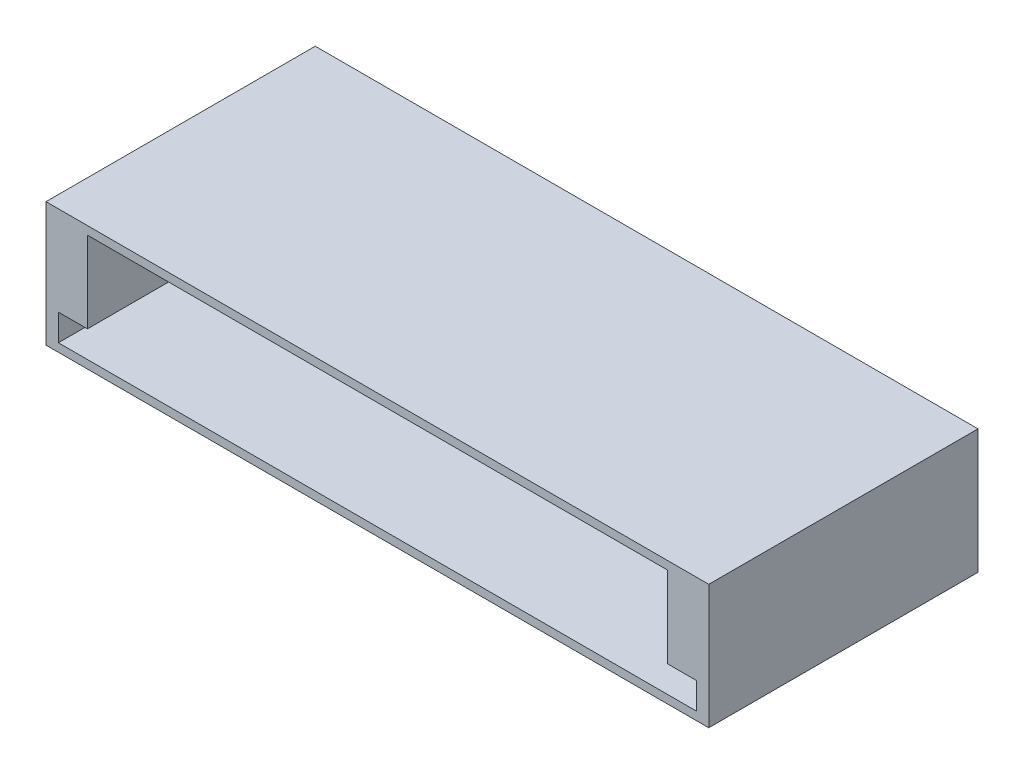
ISO-10303-21;
HEADER;
FILE_DESCRIPTION(('STEP AP214'),'2;1');
FILE_NAME('part.step','',(''),(''),'','','');
FILE_SCHEMA(('AUTOMOTIVE_DESIGN { 1 0 10303 214 1 1 1 1 }'));
ENDSEC;
DATA;
#1=APPLICATION_CONTEXT('core data for automotive mechanical design processes');
#2=APPLICATION_PROTOCOL_DEFINITION('international standard','automotive_design',2000,#1);
#3=PRODUCT_CONTEXT('',#1,'mechanical');
#4=PRODUCT('Part','Part','',(#3));
#5=PRODUCT_RELATED_PRODUCT_CATEGORY('part','',(#4));
#6=PRODUCT_DEFINITION_FORMATION('','',#4);
#7=PRODUCT_DEFINITION_CONTEXT('part definition',#1,'design');
#8=PRODUCT_DEFINITION('design','',#6,#7);
#9=PRODUCT_DEFINITION_SHAPE('','',#8);
#10=(LENGTH_UNIT() NAMED_UNIT(*) SI_UNIT(.MILLI.,.METRE.));
#11=(NAMED_UNIT(*) PLANE_ANGLE_UNIT() SI_UNIT($,.RADIAN.));
#12=(NAMED_UNIT(*) SI_UNIT($,.STERADIAN.) SOLID_ANGLE_UNIT());
#13=UNCERTAINTY_MEASURE_WITH_UNIT(LENGTH_MEASURE(1.E-05),#10,'distance_accuracy_value','');
#14=(GEOMETRIC_REPRESENTATION_CONTEXT(3) GLOBAL_UNCERTAINTY_ASSIGNED_CONTEXT((#13)) GLOBAL_UNIT_ASSIGNED_CONTEXT((#10,
#11,#12)) REPRESENTATION_CONTEXT('',''));
#15=CARTESIAN_POINT('',(0.,0.,0.));
#16=DIRECTION('',(0.,0.,1.));
#17=DIRECTION('',(1.,0.,0.));
#18=AXIS2_PLACEMENT_3D('',#15,#16,#17);
#19=CARTESIAN_POINT('',(-54.8518874800833,15.,22.8947008612522));
#20=DIRECTION('',(0.,0.,-1.));
#21=DIRECTION('',(-1.,0.,0.));
#22=AXIS2_PLACEMENT_3D('',#19,#20,#21);
#23=PLANE('',#22);
#24=DIRECTION('',(1.,0.,0.));
#25=VECTOR('',#24,1.);
#26=CARTESIAN_POINT('',(-49.8518874800834,1.,22.8947008612522));
#27=LINE('',#26,#25);
#28=CARTESIAN_POINT('',(-53.3518874800834,1.,22.8947008612522));
#29=VERTEX_POINT('',#28);
#30=CARTESIAN_POINT('',(23.6481125199167,1.,22.8947008612522));
#31=VERTEX_POINT('',#30);
#32=EDGE_CURVE('E176',#29,#31,#27,.T.);
#33=ORIENTED_EDGE('',*,*,#32,.F.);
#34=DIRECTION('',(0.,-1.,0.));
#35=VECTOR('',#34,1.);
#36=CARTESIAN_POINT('',(-53.3518874800834,1.,22.8947008612522));
#37=LINE('',#36,#35);
#38=CARTESIAN_POINT('',(-53.3518874800834,4.2,22.8947008612522));
#39=VERTEX_POINT('',#38);
#40=EDGE_CURVE('E152',#39,#29,#37,.T.);
#41=ORIENTED_EDGE('',*,*,#40,.F.);
#42=DIRECTION('',(-1.,0.,0.));
#43=VECTOR('',#42,1.);
#44=CARTESIAN_POINT('',(-53.3518874800834,4.2,22.8947008612522));
#45=LINE('',#44,#43);
#46=CARTESIAN_POINT('',(-49.8518874800834,4.2,22.8947008612522));
#47=VERTEX_POINT('',#46);
#48=EDGE_CURVE('E160',#47,#39,#45,.T.);
#49=ORIENTED_EDGE('',*,*,#48,.F.);
#50=DIRECTION('',(0.,-1.,0.));
#51=VECTOR('',#50,1.);
#52=CARTESIAN_POINT('',(-49.8518874800834,1.,22.8947008612522));
#53=LINE('',#52,#51);
#54=CARTESIAN_POINT('',(-49.8518874800834,14.,22.8947008612522));
#55=VERTEX_POINT('',#54);
#56=EDGE_CURVE('E187',#55,#47,#53,.T.);
#57=ORIENTED_EDGE('',*,*,#56,.F.);
#58=DIRECTION('',(-1.,0.,0.));
#59=VECTOR('',#58,1.);
#60=CARTESIAN_POINT('',(-49.8518874800834,14.,22.8947008612522));
#61=LINE('',#60,#59);
#62=CARTESIAN_POINT('',(20.1481125199167,14.,22.8947008612522));
#63=VERTEX_POINT('',#62);
#64=EDGE_CURVE('E184',#63,#55,#61,.T.);
#65=ORIENTED_EDGE('',*,*,#64,.F.);
#66=DIRECTION('',(0.,1.,0.));
#67=VECTOR('',#66,1.);
#68=CARTESIAN_POINT('',(20.1481125199167,1.,22.8947008612522));
#69=LINE('',#68,#67);
#70=CARTESIAN_POINT('',(20.1481125199167,4.2,22.8947008612522));
#71=VERTEX_POINT('',#70);
#72=EDGE_CURVE('E63',#71,#63,#69,.T.);
#73=ORIENTED_EDGE('',*,*,#72,.F.);
#74=CARTESIAN_POINT('',(23.6481125199167,4.2,22.8947008612522));
#75=VERTEX_POINT('',#74);
#76=EDGE_CURVE('E155',#75,#71,#45,.T.);
#77=ORIENTED_EDGE('',*,*,#76,.F.);
#78=DIRECTION('',(0.,1.,0.));
#79=VECTOR('',#78,1.);
#80=CARTESIAN_POINT('',(23.6481125199167,1.,22.8947008612522));
#81=LINE('',#80,#79);
#82=EDGE_CURVE('E136',#31,#75,#81,.T.);
#83=ORIENTED_EDGE('',*,*,#82,.F.);
#84=EDGE_LOOP('',(#33,#41,#49,#57,#65,#73,#77,#83));
#85=FACE_BOUND('',#84,.T.);
#86=DIRECTION('',(1.,0.,0.));
#87=VECTOR('',#86,1.);
#88=CARTESIAN_POINT('',(-54.8518874800833,0.,22.8947008612522));
#89=LINE('',#88,#87);
#90=CARTESIAN_POINT('',(-54.8518874800833,0.,22.8947008612522));
#91=VERTEX_POINT('',#90);
#92=CARTESIAN_POINT('',(25.1481125199166,0.,22.8947008612522));
#93=VERTEX_POINT('',#92);
#94=EDGE_CURVE('E193',#91,#93,#89,.T.);
#95=ORIENTED_EDGE('',*,*,#94,.T.);
#96=DIRECTION('',(0.,-1.,0.));
#97=VECTOR('',#96,1.);
#98=CARTESIAN_POINT('',(25.1481125199166,15.,22.8947008612522));
#99=LINE('',#98,#97);
#100=CARTESIAN_POINT('',(25.1481125199166,15.,22.8947008612522));
#101=VERTEX_POINT('',#100);
#102=EDGE_CURVE('E11',#101,#93,#99,.T.);
#103=ORIENTED_EDGE('',*,*,#102,.F.);
#104=DIRECTION('',(1.,0.,0.));
#105=VECTOR('',#104,1.);
#106=CARTESIAN_POINT('',(-54.8518874800833,15.,22.8947008612522));
#107=LINE('',#106,#105);
#108=CARTESIAN_POINT('',(-54.8518874800833,15.,22.8947008612522));
#109=VERTEX_POINT('',#108);
#110=EDGE_CURVE('E195',#109,#101,#107,.T.);
#111=ORIENTED_EDGE('',*,*,#110,.F.);
#112=DIRECTION('',(0.,-1.,0.));
#113=VECTOR('',#112,1.);
#114=CARTESIAN_POINT('',(-54.8518874800833,15.,22.8947008612522));
#115=LINE('',#114,#113);
#116=EDGE_CURVE('E206',#109,#91,#115,.T.);
#117=ORIENTED_EDGE('',*,*,#116,.T.);
#118=EDGE_LOOP('',(#95,#103,#111,#117));
#119=FACE_BOUND('',#118,.T.);
#120=ADVANCED_FACE('F41',(#85,#119),#23,.F.);
#121=CARTESIAN_POINT('',(25.1481125199166,15.,-9.60529913874782));
#122=DIRECTION('',(1.,0.,0.));
#123=DIRECTION('',(0.,0.,-1.));
#124=AXIS2_PLACEMENT_3D('',#121,#122,#123);
#125=PLANE('',#124);
#126=DIRECTION('',(0.,0.,1.));
#127=VECTOR('',#126,1.);
#128=CARTESIAN_POINT('',(25.1481125199166,0.,-9.60529913874782));
#129=LINE('',#128,#127);
#130=CARTESIAN_POINT('',(25.1481125199166,0.,-9.60529913874782));
#131=VERTEX_POINT('',#130);
#132=EDGE_CURVE('E209',#131,#93,#129,.T.);
#133=ORIENTED_EDGE('',*,*,#132,.F.);
#134=DIRECTION('',(0.,-1.,0.));
#135=VECTOR('',#134,1.);
#136=CARTESIAN_POINT('',(25.1481125199166,15.,-9.60529913874782));
#137=LINE('',#136,#135);
#138=CARTESIAN_POINT('',(25.1481125199166,15.,-9.60529913874782));
#139=VERTEX_POINT('',#138);
#140=EDGE_CURVE('E48',#139,#131,#137,.T.);
#141=ORIENTED_EDGE('',*,*,#140,.F.);
#142=DIRECTION('',(0.,0.,1.));
#143=VECTOR('',#142,1.);
#144=CARTESIAN_POINT('',(25.1481125199166,15.,-9.60529913874782));
#145=LINE('',#144,#143);
#146=EDGE_CURVE('E197',#139,#101,#145,.T.);
#147=ORIENTED_EDGE('',*,*,#146,.T.);
#148=ORIENTED_EDGE('',*,*,#102,.T.);
#149=EDGE_LOOP('',(#133,#141,#147,#148));
#150=FACE_BOUND('',#149,.T.);
#151=ADVANCED_FACE('F226',(#150),#125,.T.);
#152=CARTESIAN_POINT('',(-54.8518874800833,15.,-9.60529913874782));
#153=DIRECTION('',(0.,0.,-1.));
#154=DIRECTION('',(-1.,0.,0.));
#155=AXIS2_PLACEMENT_3D('',#152,#153,#154);
#156=PLANE('',#155);
#157=DIRECTION('',(1.,0.,0.));
#158=VECTOR('',#157,1.);
#159=CARTESIAN_POINT('',(-54.8518874800833,0.,-9.60529913874782));
#160=LINE('',#159,#158);
#161=CARTESIAN_POINT('',(-54.8518874800833,0.,-9.60529913874782));
#162=VERTEX_POINT('',#161);
#163=EDGE_CURVE('E212',#162,#131,#160,.T.);
#164=ORIENTED_EDGE('',*,*,#163,.F.);
#165=DIRECTION('',(0.,-1.,0.));
#166=VECTOR('',#165,1.);
#167=CARTESIAN_POINT('',(-54.8518874800833,15.,-9.60529913874782));
#168=LINE('',#167,#166);
#169=CARTESIAN_POINT('',(-54.8518874800833,15.,-9.60529913874782));
#170=VERTEX_POINT('',#169);
#171=EDGE_CURVE('E218',#170,#162,#168,.T.);
#172=ORIENTED_EDGE('',*,*,#171,.F.);
#173=DIRECTION('',(1.,0.,0.));
#174=VECTOR('',#173,1.);
#175=CARTESIAN_POINT('',(-54.8518874800833,15.,-9.60529913874782));
#176=LINE('',#175,#174);
#177=EDGE_CURVE('E201',#170,#139,#176,.T.);
#178=ORIENTED_EDGE('',*,*,#177,.T.);
#179=ORIENTED_EDGE('',*,*,#140,.T.);
#180=EDGE_LOOP('',(#164,#172,#178,#179));
#181=FACE_BOUND('',#180,.T.);
#182=ADVANCED_FACE('F222',(#181),#156,.T.);
#183=CARTESIAN_POINT('',(-54.8518874800833,15.,-9.60529913874782));
#184=DIRECTION('',(1.,0.,0.));
#185=DIRECTION('',(0.,0.,-1.));
#186=AXIS2_PLACEMENT_3D('',#183,#184,#185);
#187=PLANE('',#186);
#188=DIRECTION('',(0.,0.,1.));
#189=VECTOR('',#188,1.);
#190=CARTESIAN_POINT('',(-54.8518874800833,0.,-9.60529913874782));
#191=LINE('',#190,#189);
#192=EDGE_CURVE('E198',#162,#91,#191,.T.);
#193=ORIENTED_EDGE('',*,*,#192,.T.);
#194=ORIENTED_EDGE('',*,*,#116,.F.);
#195=DIRECTION('',(0.,0.,1.));
#196=VECTOR('',#195,1.);
#197=CARTESIAN_POINT('',(-54.8518874800833,15.,-9.60529913874782));
#198=LINE('',#197,#196);
#199=EDGE_CURVE('E204',#170,#109,#198,.T.);
#200=ORIENTED_EDGE('',*,*,#199,.F.);
#201=ORIENTED_EDGE('',*,*,#171,.T.);
#202=EDGE_LOOP('',(#193,#194,#200,#201));
#203=FACE_BOUND('',#202,.T.);
#204=ADVANCED_FACE('F234',(#203),#187,.F.);
#205=CARTESIAN_POINT('',(0.,15.,0.));
#206=DIRECTION('',(0.,-1.,0.));
#207=DIRECTION('',(0.,0.,-1.));
#208=AXIS2_PLACEMENT_3D('',#205,#206,#207);
#209=PLANE('',#208);
#210=ORIENTED_EDGE('',*,*,#110,.T.);
#211=ORIENTED_EDGE('',*,*,#146,.F.);
#212=ORIENTED_EDGE('',*,*,#177,.F.);
#213=ORIENTED_EDGE('',*,*,#199,.T.);
#214=EDGE_LOOP('',(#210,#211,#212,#213));
#215=FACE_BOUND('',#214,.T.);
#216=ADVANCED_FACE('F239',(#215),#209,.F.);
#217=CARTESIAN_POINT('',(0.,0.,0.));
#218=DIRECTION('',(0.,-1.,0.));
#219=DIRECTION('',(0.,0.,-1.));
#220=AXIS2_PLACEMENT_3D('',#217,#218,#219);
#221=PLANE('',#220);
#222=ORIENTED_EDGE('',*,*,#94,.F.);
#223=ORIENTED_EDGE('',*,*,#192,.F.);
#224=ORIENTED_EDGE('',*,*,#163,.T.);
#225=ORIENTED_EDGE('',*,*,#132,.T.);
#226=EDGE_LOOP('',(#222,#223,#224,#225));
#227=FACE_BOUND('',#226,.T.);
#228=ADVANCED_FACE('F231',(#227),#221,.T.);
#229=CARTESIAN_POINT('',(20.1481125199167,1.,-7.10529913874781));
#230=DIRECTION('',(1.,0.,0.));
#231=DIRECTION('',(0.,0.,-1.));
#232=AXIS2_PLACEMENT_3D('',#229,#230,#231);
#233=PLANE('',#232);
#234=DIRECTION('',(0.,1.,0.));
#235=VECTOR('',#234,1.);
#236=CARTESIAN_POINT('',(20.1481125199167,1.,-7.10529913874781));
#237=LINE('',#236,#235);
#238=CARTESIAN_POINT('',(20.1481125199167,4.2,-7.10529913874781));
#239=VERTEX_POINT('',#238);
#240=CARTESIAN_POINT('',(20.1481125199167,14.,-7.10529913874781));
#241=VERTEX_POINT('',#240);
#242=EDGE_CURVE('E173',#239,#241,#237,.T.);
#243=ORIENTED_EDGE('',*,*,#242,.F.);
#244=DIRECTION('',(0.,0.,1.));
#245=VECTOR('',#244,1.);
#246=CARTESIAN_POINT('',(20.1481125199167,4.2,-7.10529913874781));
#247=LINE('',#246,#245);
#248=EDGE_CURVE('E143',#239,#71,#247,.T.);
#249=ORIENTED_EDGE('',*,*,#248,.T.);
#250=ORIENTED_EDGE('',*,*,#72,.T.);
#251=DIRECTION('',(0.,0.,1.));
#252=VECTOR('',#251,1.);
#253=CARTESIAN_POINT('',(20.1481125199167,14.,-7.10529913874781));
#254=LINE('',#253,#252);
#255=EDGE_CURVE('E182',#241,#63,#254,.T.);
#256=ORIENTED_EDGE('',*,*,#255,.F.);
#257=EDGE_LOOP('',(#243,#249,#250,#256));
#258=FACE_BOUND('',#257,.T.);
#259=ADVANCED_FACE('F246',(#258),#233,.F.);
#260=CARTESIAN_POINT('',(-49.8518874800834,1.,-7.10529913874781));
#261=DIRECTION('',(0.,-1.,0.));
#262=DIRECTION('',(0.,0.,-1.));
#263=AXIS2_PLACEMENT_3D('',#260,#261,#262);
#264=PLANE('',#263);
#265=ORIENTED_EDGE('',*,*,#32,.T.);
#266=DIRECTION('',(0.,0.,1.));
#267=VECTOR('',#266,1.);
#268=CARTESIAN_POINT('',(23.6481125199167,1.,-7.10529913874781));
#269=LINE('',#268,#267);
#270=CARTESIAN_POINT('',(23.6481125199167,1.,-7.10529913874781));
#271=VERTEX_POINT('',#270);
#272=EDGE_CURVE('E162',#271,#31,#269,.T.);
#273=ORIENTED_EDGE('',*,*,#272,.F.);
#274=DIRECTION('',(1.,0.,0.));
#275=VECTOR('',#274,1.);
#276=CARTESIAN_POINT('',(-49.8518874800834,1.,-7.10529913874781));
#277=LINE('',#276,#275);
#278=CARTESIAN_POINT('',(-53.3518874800834,1.,-7.10529913874781));
#279=VERTEX_POINT('',#278);
#280=EDGE_CURVE('E150',#279,#271,#277,.T.);
#281=ORIENTED_EDGE('',*,*,#280,.F.);
#282=DIRECTION('',(0.,0.,1.));
#283=VECTOR('',#282,1.);
#284=CARTESIAN_POINT('',(-53.3518874800834,1.,-7.10529913874781));
#285=LINE('',#284,#283);
#286=EDGE_CURVE('E165',#279,#29,#285,.T.);
#287=ORIENTED_EDGE('',*,*,#286,.T.);
#288=EDGE_LOOP('',(#265,#273,#281,#287));
#289=FACE_BOUND('',#288,.T.);
#290=ADVANCED_FACE('F261',(#289),#264,.F.);
#291=CARTESIAN_POINT('',(-49.8518874800834,1.,-7.10529913874781));
#292=DIRECTION('',(-1.,0.,0.));
#293=DIRECTION('',(0.,0.,1.));
#294=AXIS2_PLACEMENT_3D('',#291,#292,#293);
#295=PLANE('',#294);
#296=ORIENTED_EDGE('',*,*,#56,.T.);
#297=DIRECTION('',(0.,0.,-1.));
#298=VECTOR('',#297,1.);
#299=CARTESIAN_POINT('',(-49.8518874800834,4.2,-7.10529913874781));
#300=LINE('',#299,#298);
#301=CARTESIAN_POINT('',(-49.8518874800834,4.2,-7.10529913874781));
#302=VERTEX_POINT('',#301);
#303=EDGE_CURVE('E164',#47,#302,#300,.T.);
#304=ORIENTED_EDGE('',*,*,#303,.T.);
#305=DIRECTION('',(0.,-1.,0.));
#306=VECTOR('',#305,1.);
#307=CARTESIAN_POINT('',(-49.8518874800834,1.,-7.10529913874781));
#308=LINE('',#307,#306);
#309=CARTESIAN_POINT('',(-49.8518874800834,14.,-7.10529913874781));
#310=VERTEX_POINT('',#309);
#311=EDGE_CURVE('E179',#310,#302,#308,.T.);
#312=ORIENTED_EDGE('',*,*,#311,.F.);
#313=DIRECTION('',(0.,0.,1.));
#314=VECTOR('',#313,1.);
#315=CARTESIAN_POINT('',(-49.8518874800834,14.,-7.10529913874781));
#316=LINE('',#315,#314);
#317=EDGE_CURVE('E191',#310,#55,#316,.T.);
#318=ORIENTED_EDGE('',*,*,#317,.T.);
#319=EDGE_LOOP('',(#296,#304,#312,#318));
#320=FACE_BOUND('',#319,.T.);
#321=ADVANCED_FACE('F271',(#320),#295,.F.);
#322=CARTESIAN_POINT('',(-49.8518874800834,14.,-7.10529913874781));
#323=DIRECTION('',(0.,1.,0.));
#324=DIRECTION('',(0.,0.,1.));
#325=AXIS2_PLACEMENT_3D('',#322,#323,#324);
#326=PLANE('',#325);
#327=ORIENTED_EDGE('',*,*,#64,.T.);
#328=ORIENTED_EDGE('',*,*,#317,.F.);
#329=DIRECTION('',(-1.,0.,0.));
#330=VECTOR('',#329,1.);
#331=CARTESIAN_POINT('',(-49.8518874800834,14.,-7.10529913874781));
#332=LINE('',#331,#330);
#333=EDGE_CURVE('E175',#241,#310,#332,.T.);
#334=ORIENTED_EDGE('',*,*,#333,.F.);
#335=ORIENTED_EDGE('',*,*,#255,.T.);
#336=EDGE_LOOP('',(#327,#328,#334,#335));
#337=FACE_BOUND('',#336,.T.);
#338=ADVANCED_FACE('F275',(#337),#326,.F.);
#339=CARTESIAN_POINT('',(0.,0.,-7.10529913874781));
#340=DIRECTION('',(0.,0.,-1.));
#341=DIRECTION('',(-1.,0.,0.));
#342=AXIS2_PLACEMENT_3D('',#339,#340,#341);
#343=PLANE('',#342);
#344=ORIENTED_EDGE('',*,*,#311,.T.);
#345=DIRECTION('',(-1.,0.,0.));
#346=VECTOR('',#345,1.);
#347=CARTESIAN_POINT('',(-53.3518874800834,4.2,-7.10529913874781));
#348=LINE('',#347,#346);
#349=CARTESIAN_POINT('',(-53.3518874800834,4.2,-7.10529913874781));
#350=VERTEX_POINT('',#349);
#351=EDGE_CURVE('E145',#302,#350,#348,.T.);
#352=ORIENTED_EDGE('',*,*,#351,.T.);
#353=DIRECTION('',(0.,-1.,0.));
#354=VECTOR('',#353,1.);
#355=CARTESIAN_POINT('',(-53.3518874800834,1.,-7.10529913874781));
#356=LINE('',#355,#354);
#357=EDGE_CURVE('E140',#350,#279,#356,.T.);
#358=ORIENTED_EDGE('',*,*,#357,.T.);
#359=ORIENTED_EDGE('',*,*,#280,.T.);
#360=DIRECTION('',(0.,1.,0.));
#361=VECTOR('',#360,1.);
#362=CARTESIAN_POINT('',(23.6481125199167,1.,-7.10529913874781));
#363=LINE('',#362,#361);
#364=CARTESIAN_POINT('',(23.6481125199167,4.2,-7.10529913874781));
#365=VERTEX_POINT('',#364);
#366=EDGE_CURVE('E134',#271,#365,#363,.T.);
#367=ORIENTED_EDGE('',*,*,#366,.T.);
#368=EDGE_CURVE('E55',#365,#239,#348,.T.);
#369=ORIENTED_EDGE('',*,*,#368,.T.);
#370=ORIENTED_EDGE('',*,*,#242,.T.);
#371=ORIENTED_EDGE('',*,*,#333,.T.);
#372=EDGE_LOOP('',(#344,#352,#358,#359,#367,#369,#370,#371));
#373=FACE_BOUND('',#372,.T.);
#374=ADVANCED_FACE('F148',(#373),#343,.F.);
#375=CARTESIAN_POINT('',(-53.3518874800834,4.2,-7.10529913874781));
#376=DIRECTION('',(0.,1.,0.));
#377=DIRECTION('',(0.,0.,1.));
#378=AXIS2_PLACEMENT_3D('',#375,#376,#377);
#379=PLANE('',#378);
#380=ORIENTED_EDGE('',*,*,#48,.T.);
#381=DIRECTION('',(0.,0.,1.));
#382=VECTOR('',#381,1.);
#383=CARTESIAN_POINT('',(-53.3518874800834,4.2,-7.10529913874781));
#384=LINE('',#383,#382);
#385=EDGE_CURVE('E139',#350,#39,#384,.T.);
#386=ORIENTED_EDGE('',*,*,#385,.F.);
#387=ORIENTED_EDGE('',*,*,#351,.F.);
#388=ORIENTED_EDGE('',*,*,#303,.F.);
#389=EDGE_LOOP('',(#380,#386,#387,#388));
#390=FACE_BOUND('',#389,.T.);
#391=ADVANCED_FACE('F267',(#390),#379,.F.);
#392=CARTESIAN_POINT('',(-53.3518874800834,1.,-7.10529913874781));
#393=DIRECTION('',(-1.,0.,0.));
#394=DIRECTION('',(0.,0.,1.));
#395=AXIS2_PLACEMENT_3D('',#392,#393,#394);
#396=PLANE('',#395);
#397=ORIENTED_EDGE('',*,*,#40,.T.);
#398=ORIENTED_EDGE('',*,*,#286,.F.);
#399=ORIENTED_EDGE('',*,*,#357,.F.);
#400=ORIENTED_EDGE('',*,*,#385,.T.);
#401=EDGE_LOOP('',(#397,#398,#399,#400));
#402=FACE_BOUND('',#401,.T.);
#403=ADVANCED_FACE('F264',(#402),#396,.F.);
#404=ORIENTED_EDGE('',*,*,#368,.F.);
#405=DIRECTION('',(0.,0.,1.));
#406=VECTOR('',#405,1.);
#407=CARTESIAN_POINT('',(23.6481125199167,4.2,-7.10529913874781));
#408=LINE('',#407,#406);
#409=EDGE_CURVE('E131',#365,#75,#408,.T.);
#410=ORIENTED_EDGE('',*,*,#409,.T.);
#411=ORIENTED_EDGE('',*,*,#76,.T.);
#412=ORIENTED_EDGE('',*,*,#248,.F.);
#413=EDGE_LOOP('',(#404,#410,#411,#412));
#414=FACE_BOUND('',#413,.T.);
#415=ADVANCED_FACE('F142',(#414),#379,.F.);
#416=CARTESIAN_POINT('',(23.6481125199167,1.,-7.10529913874781));
#417=DIRECTION('',(1.,0.,0.));
#418=DIRECTION('',(0.,0.,-1.));
#419=AXIS2_PLACEMENT_3D('',#416,#417,#418);
#420=PLANE('',#419);
#421=ORIENTED_EDGE('',*,*,#82,.T.);
#422=ORIENTED_EDGE('',*,*,#409,.F.);
#423=ORIENTED_EDGE('',*,*,#366,.F.);
#424=ORIENTED_EDGE('',*,*,#272,.T.);
#425=EDGE_LOOP('',(#421,#422,#423,#424));
#426=FACE_BOUND('',#425,.T.);
#427=ADVANCED_FACE('F132',(#426),#420,.F.);
#428=CLOSED_SHELL('',(#120,#151,#182,#204,#216,#228,#259,#290,#321,#338,#374,#391,#403,#415,#427));
#429=MANIFOLD_SOLID_BREP('B2',#428);
#430=ADVANCED_BREP_SHAPE_REPRESENTATION('',(#18,#429),#14);
#431=SHAPE_DEFINITION_REPRESENTATION(#9,#430);
ENDSEC;
END-ISO-10303-21;
